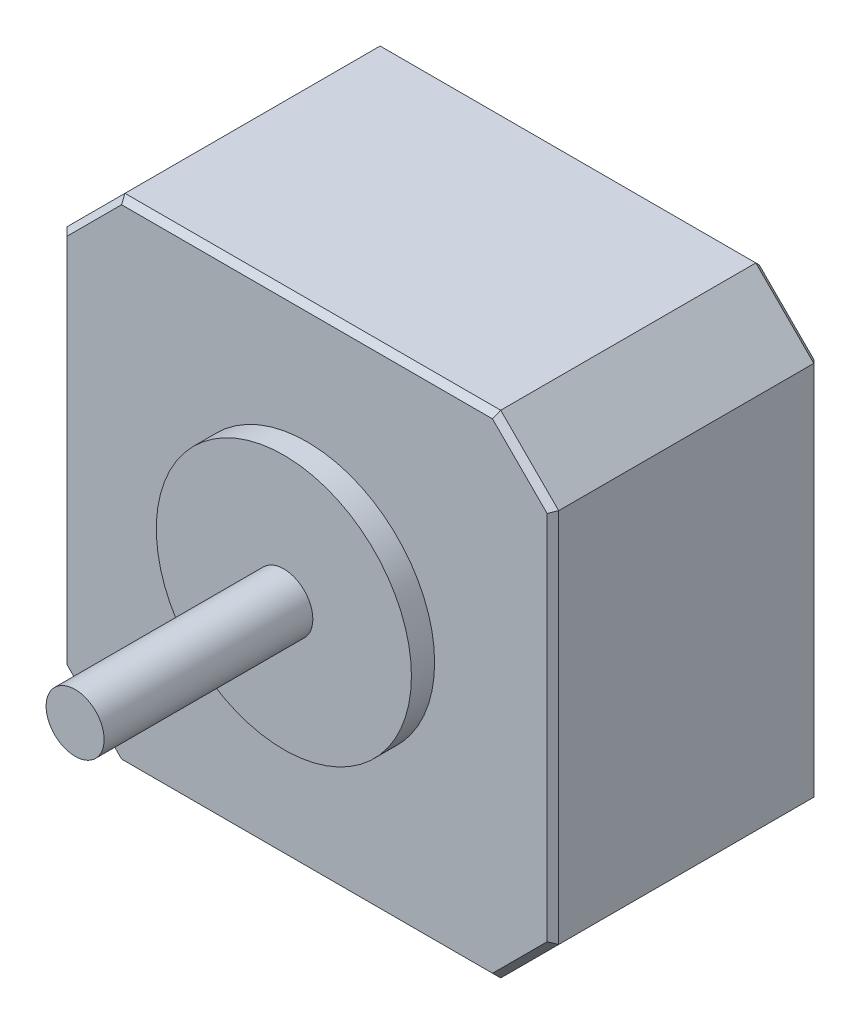
ISO-10303-21;
HEADER;
FILE_DESCRIPTION(('STEP AP214'),'2;1');
FILE_NAME('part.step','',(''),(''),'','','');
FILE_SCHEMA(('AUTOMOTIVE_DESIGN { 1 0 10303 214 1 1 1 1 }'));
ENDSEC;
DATA;
#1=APPLICATION_CONTEXT('core data for automotive mechanical design processes');
#2=APPLICATION_PROTOCOL_DEFINITION('international standard','automotive_design',2000,#1);
#3=PRODUCT_CONTEXT('',#1,'mechanical');
#4=PRODUCT('Part','Part','',(#3));
#5=PRODUCT_RELATED_PRODUCT_CATEGORY('part','',(#4));
#6=PRODUCT_DEFINITION_FORMATION('','',#4);
#7=PRODUCT_DEFINITION_CONTEXT('part definition',#1,'design');
#8=PRODUCT_DEFINITION('design','',#6,#7);
#9=PRODUCT_DEFINITION_SHAPE('','',#8);
#10=(LENGTH_UNIT() NAMED_UNIT(*) SI_UNIT(.MILLI.,.METRE.));
#11=(NAMED_UNIT(*) PLANE_ANGLE_UNIT() SI_UNIT($,.RADIAN.));
#12=(NAMED_UNIT(*) SI_UNIT($,.STERADIAN.) SOLID_ANGLE_UNIT());
#13=UNCERTAINTY_MEASURE_WITH_UNIT(LENGTH_MEASURE(1.E-05),#10,'distance_accuracy_value','');
#14=(GEOMETRIC_REPRESENTATION_CONTEXT(3) GLOBAL_UNCERTAINTY_ASSIGNED_CONTEXT((#13)) GLOBAL_UNIT_ASSIGNED_CONTEXT((#10,
#11,#12)) REPRESENTATION_CONTEXT('',''));
#15=CARTESIAN_POINT('',(0.,0.,0.));
#16=DIRECTION('',(0.,0.,1.));
#17=DIRECTION('',(1.,0.,0.));
#18=AXIS2_PLACEMENT_3D('',#15,#16,#17);
#19=CARTESIAN_POINT('',(0.,0.,0.));
#20=DIRECTION('',(0.,0.,1.));
#21=DIRECTION('',(1.,0.,0.));
#22=AXIS2_PLACEMENT_3D('',#19,#20,#21);
#23=PLANE('',#22);
#24=DIRECTION('',(0.,-1.,0.));
#25=VECTOR('',#24,1.);
#26=CARTESIAN_POINT('',(0.5,0.,0.));
#27=LINE('',#26,#25);
#28=CARTESIAN_POINT('',(0.5,37.1928932188135,0.));
#29=VERTEX_POINT('',#28);
#30=CARTESIAN_POINT('',(0.5,5.20710678118655,0.));
#31=VERTEX_POINT('',#30);
#32=EDGE_CURVE('E135',#29,#31,#27,.T.);
#33=ORIENTED_EDGE('',*,*,#32,.T.);
#34=DIRECTION('',(0.707106781186548,-0.707106781186547,0.));
#35=VECTOR('',#34,1.);
#36=CARTESIAN_POINT('',(2.85355339059328,2.85355339059328,0.));
#37=LINE('',#36,#35);
#38=CARTESIAN_POINT('',(5.20710678118655,0.5,0.));
#39=VERTEX_POINT('',#38);
#40=EDGE_CURVE('E184',#31,#39,#37,.T.);
#41=ORIENTED_EDGE('',*,*,#40,.T.);
#42=DIRECTION('',(1.,0.,0.));
#43=VECTOR('',#42,1.);
#44=CARTESIAN_POINT('',(0.,0.5,0.));
#45=LINE('',#44,#43);
#46=CARTESIAN_POINT('',(37.1928932188135,0.5,0.));
#47=VERTEX_POINT('',#46);
#48=EDGE_CURVE('E181',#39,#47,#45,.T.);
#49=ORIENTED_EDGE('',*,*,#48,.T.);
#50=DIRECTION('',(0.707106781186547,0.707106781186548,0.));
#51=VECTOR('',#50,1.);
#52=CARTESIAN_POINT('',(18.3464466094068,-18.3464466094068,0.));
#53=LINE('',#52,#51);
#54=CARTESIAN_POINT('',(41.9,5.20710678118655,0.));
#55=VERTEX_POINT('',#54);
#56=EDGE_CURVE('E178',#47,#55,#53,.T.);
#57=ORIENTED_EDGE('',*,*,#56,.T.);
#58=DIRECTION('',(0.,1.,0.));
#59=VECTOR('',#58,1.);
#60=CARTESIAN_POINT('',(41.9,0.,0.));
#61=LINE('',#60,#59);
#62=CARTESIAN_POINT('',(41.9,37.1928932188135,0.));
#63=VERTEX_POINT('',#62);
#64=EDGE_CURVE('E175',#55,#63,#61,.T.);
#65=ORIENTED_EDGE('',*,*,#64,.T.);
#66=DIRECTION('',(-0.707106781186548,0.707106781186548,0.));
#67=VECTOR('',#66,1.);
#68=CARTESIAN_POINT('',(39.5464466094068,39.5464466094068,0.));
#69=LINE('',#68,#67);
#70=CARTESIAN_POINT('',(37.1928932188135,41.9,0.));
#71=VERTEX_POINT('',#70);
#72=EDGE_CURVE('E172',#63,#71,#69,.T.);
#73=ORIENTED_EDGE('',*,*,#72,.T.);
#74=DIRECTION('',(-1.,0.,0.));
#75=VECTOR('',#74,1.);
#76=CARTESIAN_POINT('',(0.,41.9,0.));
#77=LINE('',#76,#75);
#78=CARTESIAN_POINT('',(5.20710678118654,41.9,0.));
#79=VERTEX_POINT('',#78);
#80=EDGE_CURVE('E138',#71,#79,#77,.T.);
#81=ORIENTED_EDGE('',*,*,#80,.T.);
#82=DIRECTION('',(-0.707106781186548,-0.707106781186548,0.));
#83=VECTOR('',#82,1.);
#84=CARTESIAN_POINT('',(-18.3464466094068,18.3464466094068,0.));
#85=LINE('',#84,#83);
#86=EDGE_CURVE('E130',#79,#29,#85,.T.);
#87=ORIENTED_EDGE('',*,*,#86,.T.);
#88=EDGE_LOOP('',(#33,#41,#49,#57,#65,#73,#81,#87));
#89=FACE_BOUND('',#88,.T.);
#90=CARTESIAN_POINT('',(21.2,21.2,0.));
#91=DIRECTION('',(0.,0.,1.));
#92=DIRECTION('',(1.,0.,0.));
#93=AXIS2_PLACEMENT_3D('',#90,#91,#92);
#94=CIRCLE('',#93,11.);
#95=CARTESIAN_POINT('',(32.2,21.2,0.));
#96=VERTEX_POINT('',#95);
#97=EDGE_CURVE('E391',#96,#96,#94,.T.);
#98=ORIENTED_EDGE('',*,*,#97,.F.);
#99=EDGE_LOOP('',(#98));
#100=FACE_BOUND('',#99,.T.);
#101=ADVANCED_FACE('F17',(#89,#100),#23,.T.);
#102=CARTESIAN_POINT('',(0.,42.4,-23.));
#103=DIRECTION('',(-1.,0.,0.));
#104=DIRECTION('',(0.,0.,1.));
#105=AXIS2_PLACEMENT_3D('',#102,#103,#104);
#106=PLANE('',#105);
#107=DIRECTION('',(0.,0.,1.));
#108=VECTOR('',#107,1.);
#109=CARTESIAN_POINT('',(0.,5.,-23.));
#110=LINE('',#109,#108);
#111=CARTESIAN_POINT('',(0.,5.,-22.5));
#112=VERTEX_POINT('',#111);
#113=CARTESIAN_POINT('',(0.,5.,-0.5));
#114=VERTEX_POINT('',#113);
#115=EDGE_CURVE('E327',#112,#114,#110,.T.);
#116=ORIENTED_EDGE('',*,*,#115,.T.);
#117=DIRECTION('',(0.,1.,0.));
#118=VECTOR('',#117,1.);
#119=CARTESIAN_POINT('',(0.,42.4,-0.5));
#120=LINE('',#119,#118);
#121=CARTESIAN_POINT('',(0.,37.4,-0.5));
#122=VERTEX_POINT('',#121);
#123=EDGE_CURVE('E233',#114,#122,#120,.T.);
#124=ORIENTED_EDGE('',*,*,#123,.T.);
#125=DIRECTION('',(0.,0.,-1.));
#126=VECTOR('',#125,1.);
#127=CARTESIAN_POINT('',(0.,37.4,-23.));
#128=LINE('',#127,#126);
#129=CARTESIAN_POINT('',(0.,37.4,-22.5));
#130=VERTEX_POINT('',#129);
#131=EDGE_CURVE('E345',#122,#130,#128,.T.);
#132=ORIENTED_EDGE('',*,*,#131,.T.);
#133=DIRECTION('',(0.,-1.,0.));
#134=VECTOR('',#133,1.);
#135=CARTESIAN_POINT('',(0.,5.,-22.5));
#136=LINE('',#135,#134);
#137=EDGE_CURVE('E230',#130,#112,#136,.T.);
#138=ORIENTED_EDGE('',*,*,#137,.T.);
#139=EDGE_LOOP('',(#116,#124,#132,#138));
#140=FACE_BOUND('',#139,.T.);
#141=ADVANCED_FACE('F341',(#140),#106,.T.);
#142=CARTESIAN_POINT('',(0.,0.,-23.));
#143=DIRECTION('',(0.,-1.,0.));
#144=DIRECTION('',(0.,0.,-1.));
#145=AXIS2_PLACEMENT_3D('',#142,#143,#144);
#146=PLANE('',#145);
#147=DIRECTION('',(0.,0.,1.));
#148=VECTOR('',#147,1.);
#149=CARTESIAN_POINT('',(37.4,0.,-23.));
#150=LINE('',#149,#148);
#151=CARTESIAN_POINT('',(37.4,0.,-22.5));
#152=VERTEX_POINT('',#151);
#153=CARTESIAN_POINT('',(37.4,0.,-0.5));
#154=VERTEX_POINT('',#153);
#155=EDGE_CURVE('E166',#152,#154,#150,.T.);
#156=ORIENTED_EDGE('',*,*,#155,.T.);
#157=DIRECTION('',(-1.,0.,0.));
#158=VECTOR('',#157,1.);
#159=CARTESIAN_POINT('',(0.,0.,-0.5));
#160=LINE('',#159,#158);
#161=CARTESIAN_POINT('',(5.,0.,-0.5));
#162=VERTEX_POINT('',#161);
#163=EDGE_CURVE('E197',#154,#162,#160,.T.);
#164=ORIENTED_EDGE('',*,*,#163,.T.);
#165=DIRECTION('',(0.,0.,-1.));
#166=VECTOR('',#165,1.);
#167=CARTESIAN_POINT('',(5.,0.,-23.));
#168=LINE('',#167,#166);
#169=CARTESIAN_POINT('',(5.,0.,-22.5));
#170=VERTEX_POINT('',#169);
#171=EDGE_CURVE('E159',#162,#170,#168,.T.);
#172=ORIENTED_EDGE('',*,*,#171,.T.);
#173=DIRECTION('',(1.,0.,0.));
#174=VECTOR('',#173,1.);
#175=CARTESIAN_POINT('',(37.4,0.,-22.5));
#176=LINE('',#175,#174);
#177=EDGE_CURVE('E194',#170,#152,#176,.T.);
#178=ORIENTED_EDGE('',*,*,#177,.T.);
#179=EDGE_LOOP('',(#156,#164,#172,#178));
#180=FACE_BOUND('',#179,.T.);
#181=ADVANCED_FACE('F330',(#180),#146,.T.);
#182=CARTESIAN_POINT('',(42.4,0.,-23.));
#183=DIRECTION('',(1.,0.,0.));
#184=DIRECTION('',(0.,0.,-1.));
#185=AXIS2_PLACEMENT_3D('',#182,#183,#184);
#186=PLANE('',#185);
#187=DIRECTION('',(0.,0.,1.));
#188=VECTOR('',#187,1.);
#189=CARTESIAN_POINT('',(42.4,37.4,-23.));
#190=LINE('',#189,#188);
#191=CARTESIAN_POINT('',(42.4,37.4,-22.5));
#192=VERTEX_POINT('',#191);
#193=CARTESIAN_POINT('',(42.4,37.4,-0.5));
#194=VERTEX_POINT('',#193);
#195=EDGE_CURVE('E362',#192,#194,#190,.T.);
#196=ORIENTED_EDGE('',*,*,#195,.T.);
#197=DIRECTION('',(0.,-1.,0.));
#198=VECTOR('',#197,1.);
#199=CARTESIAN_POINT('',(42.4,0.,-0.5));
#200=LINE('',#199,#198);
#201=CARTESIAN_POINT('',(42.4,5.,-0.5));
#202=VERTEX_POINT('',#201);
#203=EDGE_CURVE('E209',#194,#202,#200,.T.);
#204=ORIENTED_EDGE('',*,*,#203,.T.);
#205=DIRECTION('',(0.,0.,-1.));
#206=VECTOR('',#205,1.);
#207=CARTESIAN_POINT('',(42.4,5.,-23.));
#208=LINE('',#207,#206);
#209=CARTESIAN_POINT('',(42.4,5.,-22.5));
#210=VERTEX_POINT('',#209);
#211=EDGE_CURVE('E352',#202,#210,#208,.T.);
#212=ORIENTED_EDGE('',*,*,#211,.T.);
#213=DIRECTION('',(0.,1.,0.));
#214=VECTOR('',#213,1.);
#215=CARTESIAN_POINT('',(42.4,37.4,-22.5));
#216=LINE('',#215,#214);
#217=EDGE_CURVE('E206',#210,#192,#216,.T.);
#218=ORIENTED_EDGE('',*,*,#217,.T.);
#219=EDGE_LOOP('',(#196,#204,#212,#218));
#220=FACE_BOUND('',#219,.T.);
#221=ADVANCED_FACE('F824',(#220),#186,.T.);
#222=CARTESIAN_POINT('',(42.4,42.4,-23.));
#223=DIRECTION('',(0.,1.,0.));
#224=DIRECTION('',(0.,0.,1.));
#225=AXIS2_PLACEMENT_3D('',#222,#223,#224);
#226=PLANE('',#225);
#227=DIRECTION('',(0.,0.,1.));
#228=VECTOR('',#227,1.);
#229=CARTESIAN_POINT('',(5.,42.4,-23.));
#230=LINE('',#229,#228);
#231=CARTESIAN_POINT('',(5.,42.4,-22.5));
#232=VERTEX_POINT('',#231);
#233=CARTESIAN_POINT('',(5.,42.4,-0.5));
#234=VERTEX_POINT('',#233);
#235=EDGE_CURVE('E346',#232,#234,#230,.T.);
#236=ORIENTED_EDGE('',*,*,#235,.T.);
#237=DIRECTION('',(1.,0.,0.));
#238=VECTOR('',#237,1.);
#239=CARTESIAN_POINT('',(42.4,42.4,-0.5));
#240=LINE('',#239,#238);
#241=CARTESIAN_POINT('',(37.4,42.4,-0.5));
#242=VERTEX_POINT('',#241);
#243=EDGE_CURVE('E222',#234,#242,#240,.T.);
#244=ORIENTED_EDGE('',*,*,#243,.T.);
#245=DIRECTION('',(0.,0.,-1.));
#246=VECTOR('',#245,1.);
#247=CARTESIAN_POINT('',(37.4,42.4,-23.));
#248=LINE('',#247,#246);
#249=CARTESIAN_POINT('',(37.4,42.4,-22.5));
#250=VERTEX_POINT('',#249);
#251=EDGE_CURVE('E355',#242,#250,#248,.T.);
#252=ORIENTED_EDGE('',*,*,#251,.T.);
#253=DIRECTION('',(-1.,0.,0.));
#254=VECTOR('',#253,1.);
#255=CARTESIAN_POINT('',(5.,42.4,-22.5));
#256=LINE('',#255,#254);
#257=EDGE_CURVE('E219',#250,#232,#256,.T.);
#258=ORIENTED_EDGE('',*,*,#257,.T.);
#259=EDGE_LOOP('',(#236,#244,#252,#258));
#260=FACE_BOUND('',#259,.T.);
#261=ADVANCED_FACE('F811',(#260),#226,.T.);
#262=CARTESIAN_POINT('',(0.,0.,-23.));
#263=DIRECTION('',(0.,0.,1.));
#264=DIRECTION('',(1.,0.,0.));
#265=AXIS2_PLACEMENT_3D('',#262,#263,#264);
#266=PLANE('',#265);
#267=DIRECTION('',(1.,0.,0.));
#268=VECTOR('',#267,1.);
#269=CARTESIAN_POINT('',(37.4,41.9,-23.));
#270=LINE('',#269,#268);
#271=CARTESIAN_POINT('',(5.20710678118654,41.9,-23.));
#272=VERTEX_POINT('',#271);
#273=CARTESIAN_POINT('',(37.1928932188135,41.9,-23.));
#274=VERTEX_POINT('',#273);
#275=EDGE_CURVE('E27',#272,#274,#270,.T.);
#276=ORIENTED_EDGE('',*,*,#275,.T.);
#277=DIRECTION('',(0.707106781186548,-0.707106781186548,0.));
#278=VECTOR('',#277,1.);
#279=CARTESIAN_POINT('',(42.0464466094068,37.0464466094068,-23.));
#280=LINE('',#279,#278);
#281=CARTESIAN_POINT('',(41.9,37.1928932188135,-23.));
#282=VERTEX_POINT('',#281);
#283=EDGE_CURVE('E10',#274,#282,#280,.T.);
#284=ORIENTED_EDGE('',*,*,#283,.T.);
#285=DIRECTION('',(0.,-1.,0.));
#286=VECTOR('',#285,1.);
#287=CARTESIAN_POINT('',(41.9,5.,-23.));
#288=LINE('',#287,#286);
#289=CARTESIAN_POINT('',(41.9,5.20710678118655,-23.));
#290=VERTEX_POINT('',#289);
#291=EDGE_CURVE('E236',#282,#290,#288,.T.);
#292=ORIENTED_EDGE('',*,*,#291,.T.);
#293=DIRECTION('',(-0.707106781186547,-0.707106781186548,0.));
#294=VECTOR('',#293,1.);
#295=CARTESIAN_POINT('',(37.0464466094068,0.353553390593275,-23.));
#296=LINE('',#295,#294);
#297=CARTESIAN_POINT('',(37.1928932188135,0.5,-23.));
#298=VERTEX_POINT('',#297);
#299=EDGE_CURVE('E239',#290,#298,#296,.T.);
#300=ORIENTED_EDGE('',*,*,#299,.T.);
#301=DIRECTION('',(-1.,0.,0.));
#302=VECTOR('',#301,1.);
#303=CARTESIAN_POINT('',(5.,0.5,-23.));
#304=LINE('',#303,#302);
#305=CARTESIAN_POINT('',(5.20710678118655,0.5,-23.));
#306=VERTEX_POINT('',#305);
#307=EDGE_CURVE('E242',#298,#306,#304,.T.);
#308=ORIENTED_EDGE('',*,*,#307,.T.);
#309=DIRECTION('',(-0.707106781186548,0.707106781186547,0.));
#310=VECTOR('',#309,1.);
#311=CARTESIAN_POINT('',(0.353553390593274,5.35355339059327,-23.));
#312=LINE('',#311,#310);
#313=CARTESIAN_POINT('',(0.5,5.20710678118655,-23.));
#314=VERTEX_POINT('',#313);
#315=EDGE_CURVE('E245',#306,#314,#312,.T.);
#316=ORIENTED_EDGE('',*,*,#315,.T.);
#317=DIRECTION('',(0.,1.,0.));
#318=VECTOR('',#317,1.);
#319=CARTESIAN_POINT('',(0.5,37.4,-23.));
#320=LINE('',#319,#318);
#321=CARTESIAN_POINT('',(0.5,37.1928932188135,-23.));
#322=VERTEX_POINT('',#321);
#323=EDGE_CURVE('E248',#314,#322,#320,.T.);
#324=ORIENTED_EDGE('',*,*,#323,.T.);
#325=DIRECTION('',(0.707106781186548,0.707106781186548,0.));
#326=VECTOR('',#325,1.);
#327=CARTESIAN_POINT('',(5.35355339059327,42.0464466094068,-23.));
#328=LINE('',#327,#326);
#329=EDGE_CURVE('E38',#322,#272,#328,.T.);
#330=ORIENTED_EDGE('',*,*,#329,.T.);
#331=EDGE_LOOP('',(#276,#284,#292,#300,#308,#316,#324,#330));
#332=FACE_BOUND('',#331,.T.);
#333=ADVANCED_FACE('F799',(#332),#266,.F.);
#334=CARTESIAN_POINT('',(21.2,21.2,2.));
#335=DIRECTION('',(0.,0.,-1.));
#336=DIRECTION('',(-1.,0.,0.));
#337=AXIS2_PLACEMENT_3D('',#334,#335,#336);
#338=CYLINDRICAL_SURFACE('',#337,11.);
#339=CARTESIAN_POINT('',(21.2,21.2,2.));
#340=DIRECTION('',(0.,0.,1.));
#341=DIRECTION('',(1.,0.,0.));
#342=AXIS2_PLACEMENT_3D('',#339,#340,#341);
#343=CIRCLE('',#342,11.);
#344=CARTESIAN_POINT('',(32.2,21.2,2.));
#345=VERTEX_POINT('',#344);
#346=EDGE_CURVE('E399',#345,#345,#343,.T.);
#347=ORIENTED_EDGE('',*,*,#346,.F.);
#348=EDGE_LOOP('',(#347));
#349=FACE_BOUND('',#348,.T.);
#350=ORIENTED_EDGE('',*,*,#97,.T.);
#351=EDGE_LOOP('',(#350));
#352=FACE_BOUND('',#351,.T.);
#353=ADVANCED_FACE('F788',(#349,#352),#338,.T.);
#354=CARTESIAN_POINT('',(21.2,21.2,2.));
#355=DIRECTION('',(0.,0.,1.));
#356=DIRECTION('',(1.,0.,0.));
#357=AXIS2_PLACEMENT_3D('',#354,#355,#356);
#358=PLANE('',#357);
#359=ORIENTED_EDGE('',*,*,#346,.T.);
#360=EDGE_LOOP('',(#359));
#361=FACE_BOUND('',#360,.T.);
#362=CARTESIAN_POINT('',(21.2,21.2,2.));
#363=DIRECTION('',(0.,0.,-1.));
#364=DIRECTION('',(1.,0.,0.));
#365=AXIS2_PLACEMENT_3D('',#362,#363,#364);
#366=CIRCLE('',#365,2.5);
#367=CARTESIAN_POINT('',(23.7,21.2,2.));
#368=VERTEX_POINT('',#367);
#369=EDGE_CURVE('E406',#368,#368,#366,.T.);
#370=ORIENTED_EDGE('',*,*,#369,.T.);
#371=EDGE_LOOP('',(#370));
#372=FACE_BOUND('',#371,.T.);
#373=ADVANCED_FACE('F776',(#361,#372),#358,.T.);
#374=CARTESIAN_POINT('',(21.2,21.2,20.));
#375=DIRECTION('',(0.,0.,-1.));
#376=DIRECTION('',(-1.,0.,0.));
#377=AXIS2_PLACEMENT_3D('',#374,#375,#376);
#378=CYLINDRICAL_SURFACE('',#377,2.5);
#379=ORIENTED_EDGE('',*,*,#369,.F.);
#380=EDGE_LOOP('',(#379));
#381=FACE_BOUND('',#380,.T.);
#382=CARTESIAN_POINT('',(21.2,21.2,20.));
#383=DIRECTION('',(0.,0.,1.));
#384=DIRECTION('',(1.,0.,0.));
#385=AXIS2_PLACEMENT_3D('',#382,#383,#384);
#386=CIRCLE('',#385,2.5);
#387=CARTESIAN_POINT('',(23.7,21.2,20.));
#388=VERTEX_POINT('',#387);
#389=EDGE_CURVE('E277',#388,#388,#386,.T.);
#390=ORIENTED_EDGE('',*,*,#389,.F.);
#391=EDGE_LOOP('',(#390));
#392=FACE_BOUND('',#391,.T.);
#393=ADVANCED_FACE('F764',(#381,#392),#378,.T.);
#394=CARTESIAN_POINT('',(21.2,21.2,20.));
#395=DIRECTION('',(0.,0.,1.));
#396=DIRECTION('',(1.,0.,0.));
#397=AXIS2_PLACEMENT_3D('',#394,#395,#396);
#398=PLANE('',#397);
#399=ORIENTED_EDGE('',*,*,#389,.T.);
#400=EDGE_LOOP('',(#399));
#401=FACE_BOUND('',#400,.T.);
#402=ADVANCED_FACE('F752',(#401),#398,.T.);
#403=CARTESIAN_POINT('',(5.,42.4,-23.));
#404=DIRECTION('',(0.707106781186548,-0.707106781186548,0.));
#405=DIRECTION('',(0.,0.,1.));
#406=AXIS2_PLACEMENT_3D('',#403,#404,#405);
#407=PLANE('',#406);
#408=ORIENTED_EDGE('',*,*,#131,.F.);
#409=DIRECTION('',(-0.707106781186548,-0.707106781186548,0.));
#410=VECTOR('',#409,1.);
#411=CARTESIAN_POINT('',(5.,42.4,-0.5));
#412=LINE('',#411,#410);
#413=EDGE_CURVE('E148',#122,#234,#412,.F.);
#414=ORIENTED_EDGE('',*,*,#413,.T.);
#415=ORIENTED_EDGE('',*,*,#235,.F.);
#416=DIRECTION('',(0.707106781186548,0.707106781186548,0.));
#417=VECTOR('',#416,1.);
#418=CARTESIAN_POINT('',(0.,37.4,-22.5));
#419=LINE('',#418,#417);
#420=EDGE_CURVE('E225',#232,#130,#419,.F.);
#421=ORIENTED_EDGE('',*,*,#420,.T.);
#422=EDGE_LOOP('',(#408,#414,#415,#421));
#423=FACE_BOUND('',#422,.T.);
#424=ADVANCED_FACE('F740',(#423),#407,.F.);
#425=CARTESIAN_POINT('',(42.4,37.4,-23.));
#426=DIRECTION('',(-0.707106781186548,-0.707106781186548,0.));
#427=DIRECTION('',(0.,0.,1.));
#428=AXIS2_PLACEMENT_3D('',#425,#426,#427);
#429=PLANE('',#428);
#430=ORIENTED_EDGE('',*,*,#251,.F.);
#431=DIRECTION('',(-0.707106781186548,0.707106781186548,0.));
#432=VECTOR('',#431,1.);
#433=CARTESIAN_POINT('',(42.4,37.4,-0.5));
#434=LINE('',#433,#432);
#435=EDGE_CURVE('E216',#242,#194,#434,.F.);
#436=ORIENTED_EDGE('',*,*,#435,.T.);
#437=ORIENTED_EDGE('',*,*,#195,.F.);
#438=DIRECTION('',(0.707106781186548,-0.707106781186548,0.));
#439=VECTOR('',#438,1.);
#440=CARTESIAN_POINT('',(37.4,42.4,-22.5));
#441=LINE('',#440,#439);
#442=EDGE_CURVE('E212',#192,#250,#441,.F.);
#443=ORIENTED_EDGE('',*,*,#442,.T.);
#444=EDGE_LOOP('',(#430,#436,#437,#443));
#445=FACE_BOUND('',#444,.T.);
#446=ADVANCED_FACE('F729',(#445),#429,.F.);
#447=CARTESIAN_POINT('',(0.,5.,-23.));
#448=DIRECTION('',(0.707106781186547,0.707106781186548,0.));
#449=DIRECTION('',(0.,0.,1.));
#450=AXIS2_PLACEMENT_3D('',#447,#448,#449);
#451=PLANE('',#450);
#452=ORIENTED_EDGE('',*,*,#171,.F.);
#453=DIRECTION('',(0.707106781186548,-0.707106781186547,0.));
#454=VECTOR('',#453,1.);
#455=CARTESIAN_POINT('',(0.,5.,-0.5));
#456=LINE('',#455,#454);
#457=EDGE_CURVE('E190',#162,#114,#456,.F.);
#458=ORIENTED_EDGE('',*,*,#457,.T.);
#459=ORIENTED_EDGE('',*,*,#115,.F.);
#460=DIRECTION('',(-0.707106781186548,0.707106781186547,0.));
#461=VECTOR('',#460,1.);
#462=CARTESIAN_POINT('',(5.,0.,-22.5));
#463=LINE('',#462,#461);
#464=EDGE_CURVE('E187',#112,#170,#463,.F.);
#465=ORIENTED_EDGE('',*,*,#464,.T.);
#466=EDGE_LOOP('',(#452,#458,#459,#465));
#467=FACE_BOUND('',#466,.T.);
#468=ADVANCED_FACE('F324',(#467),#451,.F.);
#469=CARTESIAN_POINT('',(37.4,0.,-23.));
#470=DIRECTION('',(-0.707106781186548,0.707106781186547,0.));
#471=DIRECTION('',(0.,0.,1.));
#472=AXIS2_PLACEMENT_3D('',#469,#470,#471);
#473=PLANE('',#472);
#474=ORIENTED_EDGE('',*,*,#211,.F.);
#475=DIRECTION('',(0.707106781186547,0.707106781186548,0.));
#476=VECTOR('',#475,1.);
#477=CARTESIAN_POINT('',(37.4,0.,-0.5));
#478=LINE('',#477,#476);
#479=EDGE_CURVE('E203',#202,#154,#478,.F.);
#480=ORIENTED_EDGE('',*,*,#479,.T.);
#481=ORIENTED_EDGE('',*,*,#155,.F.);
#482=DIRECTION('',(-0.707106781186547,-0.707106781186548,0.));
#483=VECTOR('',#482,1.);
#484=CARTESIAN_POINT('',(42.4,5.,-22.5));
#485=LINE('',#484,#483);
#486=EDGE_CURVE('E200',#152,#210,#485,.F.);
#487=ORIENTED_EDGE('',*,*,#486,.T.);
#488=EDGE_LOOP('',(#474,#480,#481,#487));
#489=FACE_BOUND('',#488,.T.);
#490=ADVANCED_FACE('F706',(#489),#473,.F.);
#491=CARTESIAN_POINT('',(39.5464466094068,39.5464466094068,0.));
#492=DIRECTION('',(0.500000000000008,0.500000000000008,0.707106781186536));
#493=DIRECTION('',(0.707106781186548,-0.707106781186548,0.));
#494=AXIS2_PLACEMENT_3D('',#491,#492,#493);
#495=PLANE('',#494);
#496=DIRECTION('',(-0.678598344545853,-0.281084637714791,0.678598344545853));
#497=VECTOR('',#496,1.);
#498=CARTESIAN_POINT('',(41.2651239283051,36.9299189394913,0.634876071694969));
#499=LINE('',#498,#497);
#500=EDGE_CURVE('E269',#194,#63,#499,.T.);
#501=ORIENTED_EDGE('',*,*,#500,.F.);
#502=ORIENTED_EDGE('',*,*,#435,.F.);
#503=DIRECTION('',(-0.281084637714791,-0.678598344545853,0.678598344545853));
#504=VECTOR('',#503,1.);
#505=CARTESIAN_POINT('',(34.2543357790533,34.8056947751179,7.09430522488211));
#506=LINE('',#505,#504);
#507=EDGE_CURVE('E273',#71,#242,#506,.F.);
#508=ORIENTED_EDGE('',*,*,#507,.F.);
#509=ORIENTED_EDGE('',*,*,#72,.F.);
#510=EDGE_LOOP('',(#501,#502,#508,#509));
#511=FACE_BOUND('',#510,.T.);
#512=ADVANCED_FACE('F695',(#511),#495,.T.);
#513=CARTESIAN_POINT('',(0.,41.9,0.));
#514=DIRECTION('',(0.,-0.707106781186548,-0.707106781186548));
#515=DIRECTION('',(-1.,0.,0.));
#516=AXIS2_PLACEMENT_3D('',#513,#514,#515);
#517=PLANE('',#516);
#518=ORIENTED_EDGE('',*,*,#507,.T.);
#519=ORIENTED_EDGE('',*,*,#243,.F.);
#520=DIRECTION('',(0.281084637714808,-0.67859834454585,0.67859834454585));
#521=VECTOR('',#520,1.);
#522=CARTESIAN_POINT('',(7.83886298145973,35.5463784884407,6.35362151155931));
#523=LINE('',#522,#521);
#524=EDGE_CURVE('E266',#79,#234,#523,.F.);
#525=ORIENTED_EDGE('',*,*,#524,.F.);
#526=ORIENTED_EDGE('',*,*,#80,.F.);
#527=EDGE_LOOP('',(#518,#519,#525,#526));
#528=FACE_BOUND('',#527,.T.);
#529=ADVANCED_FACE('F684',(#528),#517,.F.);
#530=CARTESIAN_POINT('',(41.9,0.,0.));
#531=DIRECTION('',(-0.707106781186548,0.,-0.707106781186548));
#532=DIRECTION('',(0.,1.,0.));
#533=AXIS2_PLACEMENT_3D('',#530,#531,#532);
#534=PLANE('',#533);
#535=ORIENTED_EDGE('',*,*,#500,.T.);
#536=ORIENTED_EDGE('',*,*,#64,.F.);
#537=DIRECTION('',(-0.678598344545848,0.281084637714818,0.678598344545848));
#538=VECTOR('',#537,1.);
#539=CARTESIAN_POINT('',(42.8932221359323,4.7957007020342,-0.993222135932357));
#540=LINE('',#539,#538);
#541=EDGE_CURVE('E152',#202,#55,#540,.T.);
#542=ORIENTED_EDGE('',*,*,#541,.F.);
#543=ORIENTED_EDGE('',*,*,#203,.F.);
#544=EDGE_LOOP('',(#535,#536,#542,#543));
#545=FACE_BOUND('',#544,.T.);
#546=ADVANCED_FACE('F674',(#545),#534,.F.);
#547=CARTESIAN_POINT('',(-18.3464466094068,18.3464466094068,0.));
#548=DIRECTION('',(-0.5,0.5,0.707106781186543));
#549=DIRECTION('',(0.707106781186548,0.707106781186548,0.));
#550=AXIS2_PLACEMENT_3D('',#547,#548,#549);
#551=PLANE('',#550);
#552=ORIENTED_EDGE('',*,*,#524,.T.);
#553=ORIENTED_EDGE('',*,*,#413,.F.);
#554=DIRECTION('',(0.678598344545849,-0.281084637714809,0.67859834454585));
#555=VECTOR('',#554,1.);
#556=CARTESIAN_POINT('',(7.59430522488252,34.254335779053,7.09430522488253));
#557=LINE('',#556,#555);
#558=EDGE_CURVE('E146',#29,#122,#557,.F.);
#559=ORIENTED_EDGE('',*,*,#558,.F.);
#560=ORIENTED_EDGE('',*,*,#86,.F.);
#561=EDGE_LOOP('',(#552,#553,#559,#560));
#562=FACE_BOUND('',#561,.T.);
#563=ADVANCED_FACE('F147',(#562),#551,.T.);
#564=CARTESIAN_POINT('',(18.3464466094068,-18.3464466094068,0.));
#565=DIRECTION('',(0.5,-0.5,0.707106781186547));
#566=DIRECTION('',(-0.707106781186547,-0.707106781186548,0.));
#567=AXIS2_PLACEMENT_3D('',#564,#565,#566);
#568=PLANE('',#567);
#569=ORIENTED_EDGE('',*,*,#541,.T.);
#570=ORIENTED_EDGE('',*,*,#56,.F.);
#571=DIRECTION('',(-0.281084637714818,0.678598344545847,0.678598344545848));
#572=VECTOR('',#571,1.);
#573=CARTESIAN_POINT('',(39.2987008604423,-4.58386936816927,-5.08386936816927));
#574=LINE('',#573,#572);
#575=EDGE_CURVE('E153',#154,#47,#574,.T.);
#576=ORIENTED_EDGE('',*,*,#575,.F.);
#577=ORIENTED_EDGE('',*,*,#479,.F.);
#578=EDGE_LOOP('',(#569,#570,#576,#577));
#579=FACE_BOUND('',#578,.T.);
#580=ADVANCED_FACE('F654',(#579),#568,.T.);
#581=CARTESIAN_POINT('',(0.5,0.,0.));
#582=DIRECTION('',(0.707106781186548,0.,-0.707106781186547));
#583=DIRECTION('',(0.,-1.,0.));
#584=AXIS2_PLACEMENT_3D('',#581,#582,#583);
#585=PLANE('',#584);
#586=ORIENTED_EDGE('',*,*,#558,.T.);
#587=ORIENTED_EDGE('',*,*,#123,.F.);
#588=DIRECTION('',(-0.678598344545847,-0.281084637714821,-0.678598344545847));
#589=VECTOR('',#588,1.);
#590=CARTESIAN_POINT('',(-0.493222135932367,4.79570070203418,-0.993222135932368));
#591=LINE('',#590,#589);
#592=EDGE_CURVE('E156',#31,#114,#591,.T.);
#593=ORIENTED_EDGE('',*,*,#592,.F.);
#594=ORIENTED_EDGE('',*,*,#32,.F.);
#595=EDGE_LOOP('',(#586,#587,#593,#594));
#596=FACE_BOUND('',#595,.T.);
#597=ADVANCED_FACE('F155',(#596),#585,.F.);
#598=CARTESIAN_POINT('',(0.,0.5,0.));
#599=DIRECTION('',(0.,0.707106781186548,-0.707106781186547));
#600=DIRECTION('',(1.,0.,0.));
#601=AXIS2_PLACEMENT_3D('',#598,#599,#600);
#602=PLANE('',#601);
#603=ORIENTED_EDGE('',*,*,#575,.T.);
#604=ORIENTED_EDGE('',*,*,#48,.F.);
#605=DIRECTION('',(0.281084637714821,0.678598344545847,0.678598344545847));
#606=VECTOR('',#605,1.);
#607=CARTESIAN_POINT('',(4.79570070203419,-0.493222135932368,-0.993222135932368));
#608=LINE('',#607,#606);
#609=EDGE_CURVE('E255',#162,#39,#608,.T.);
#610=ORIENTED_EDGE('',*,*,#609,.F.);
#611=ORIENTED_EDGE('',*,*,#163,.F.);
#612=EDGE_LOOP('',(#603,#604,#610,#611));
#613=FACE_BOUND('',#612,.T.);
#614=ADVANCED_FACE('F336',(#613),#602,.F.);
#615=CARTESIAN_POINT('',(2.85355339059328,2.85355339059328,0.));
#616=DIRECTION('',(-0.5,-0.5,0.707106781186547));
#617=DIRECTION('',(-0.707106781186548,0.707106781186547,0.));
#618=AXIS2_PLACEMENT_3D('',#615,#616,#617);
#619=PLANE('',#618);
#620=ORIENTED_EDGE('',*,*,#592,.T.);
#621=ORIENTED_EDGE('',*,*,#457,.F.);
#622=ORIENTED_EDGE('',*,*,#609,.T.);
#623=ORIENTED_EDGE('',*,*,#40,.F.);
#624=EDGE_LOOP('',(#620,#621,#622,#623));
#625=FACE_BOUND('',#624,.T.);
#626=ADVANCED_FACE('F339',(#625),#619,.T.);
#627=CARTESIAN_POINT('',(2.85355339059328,2.85355339059328,-23.));
#628=DIRECTION('',(0.5,0.5,0.707106781186547));
#629=DIRECTION('',(-0.707106781186548,0.707106781186547,0.));
#630=AXIS2_PLACEMENT_3D('',#627,#628,#629);
#631=PLANE('',#630);
#632=DIRECTION('',(-0.281084637714821,-0.678598344545847,0.678598344545847));
#633=VECTOR('',#632,1.);
#634=CARTESIAN_POINT('',(4.60495713220364,-0.953717849152732,-21.5462821508473));
#635=LINE('',#634,#633);
#636=EDGE_CURVE('E299',#170,#306,#635,.F.);
#637=ORIENTED_EDGE('',*,*,#636,.F.);
#638=ORIENTED_EDGE('',*,*,#464,.F.);
#639=DIRECTION('',(-0.678598344545847,-0.281084637714821,0.678598344545847));
#640=VECTOR('',#639,1.);
#641=CARTESIAN_POINT('',(1.13487607169491,5.47008106050873,-23.6348760716949));
#642=LINE('',#641,#640);
#643=EDGE_CURVE('E21',#314,#112,#642,.T.);
#644=ORIENTED_EDGE('',*,*,#643,.F.);
#645=ORIENTED_EDGE('',*,*,#315,.F.);
#646=EDGE_LOOP('',(#637,#638,#644,#645));
#647=FACE_BOUND('',#646,.T.);
#648=ADVANCED_FACE('F19',(#647),#631,.F.);
#649=CARTESIAN_POINT('',(0.,42.4,-22.5));
#650=DIRECTION('',(-0.707106781186548,0.,-0.707106781186547));
#651=DIRECTION('',(0.,1.,0.));
#652=AXIS2_PLACEMENT_3D('',#649,#650,#651);
#653=PLANE('',#652);
#654=ORIENTED_EDGE('',*,*,#643,.T.);
#655=ORIENTED_EDGE('',*,*,#137,.F.);
#656=DIRECTION('',(-0.678598344545847,0.281084637714821,0.678598344545847));
#657=VECTOR('',#656,1.);
#658=CARTESIAN_POINT('',(-0.953717849152731,37.7950428677963,-21.5462821508473));
#659=LINE('',#658,#657);
#660=EDGE_CURVE('E296',#322,#130,#659,.T.);
#661=ORIENTED_EDGE('',*,*,#660,.F.);
#662=ORIENTED_EDGE('',*,*,#323,.F.);
#663=EDGE_LOOP('',(#654,#655,#661,#662));
#664=FACE_BOUND('',#663,.T.);
#665=ADVANCED_FACE('F316',(#664),#653,.T.);
#666=CARTESIAN_POINT('',(0.,0.,-22.5));
#667=DIRECTION('',(0.,-0.707106781186548,-0.707106781186547));
#668=DIRECTION('',(-1.,0.,0.));
#669=AXIS2_PLACEMENT_3D('',#666,#667,#668);
#670=PLANE('',#669);
#671=ORIENTED_EDGE('',*,*,#636,.T.);
#672=ORIENTED_EDGE('',*,*,#307,.F.);
#673=DIRECTION('',(0.281084637714818,-0.678598344545847,0.678598344545848));
#674=VECTOR('',#673,1.);
#675=CARTESIAN_POINT('',(39.2987008604423,-4.58386936816927,-17.9161306318308));
#676=LINE('',#675,#674);
#677=EDGE_CURVE('E292',#152,#298,#676,.F.);
#678=ORIENTED_EDGE('',*,*,#677,.F.);
#679=ORIENTED_EDGE('',*,*,#177,.F.);
#680=EDGE_LOOP('',(#671,#672,#678,#679));
#681=FACE_BOUND('',#680,.T.);
#682=ADVANCED_FACE('F593',(#681),#670,.T.);
#683=CARTESIAN_POINT('',(-18.3464466094068,18.3464466094068,-23.));
#684=DIRECTION('',(0.5,-0.5,0.707106781186548));
#685=DIRECTION('',(0.707106781186548,0.707106781186548,0.));
#686=AXIS2_PLACEMENT_3D('',#683,#684,#685);
#687=PLANE('',#686);
#688=ORIENTED_EDGE('',*,*,#660,.T.);
#689=ORIENTED_EDGE('',*,*,#420,.F.);
#690=DIRECTION('',(-0.28108463771482,0.678598344545847,0.678598344545847));
#691=VECTOR('',#690,1.);
#692=CARTESIAN_POINT('',(7.83886298145975,35.546378488441,-29.353621511559));
#693=LINE('',#692,#691);
#694=EDGE_CURVE('E288',#272,#232,#693,.T.);
#695=ORIENTED_EDGE('',*,*,#694,.F.);
#696=ORIENTED_EDGE('',*,*,#329,.F.);
#697=EDGE_LOOP('',(#688,#689,#695,#696));
#698=FACE_BOUND('',#697,.T.);
#699=ADVANCED_FACE('F581',(#698),#687,.F.);
#700=CARTESIAN_POINT('',(18.3464466094068,-18.3464466094068,-23.));
#701=DIRECTION('',(-0.5,0.5,0.707106781186547));
#702=DIRECTION('',(-0.707106781186547,-0.707106781186548,0.));
#703=AXIS2_PLACEMENT_3D('',#700,#701,#702);
#704=PLANE('',#703);
#705=ORIENTED_EDGE('',*,*,#677,.T.);
#706=ORIENTED_EDGE('',*,*,#299,.F.);
#707=DIRECTION('',(0.678598344545848,-0.281084637714818,0.678598344545848));
#708=VECTOR('',#707,1.);
#709=CARTESIAN_POINT('',(43.3537178491527,4.60495713220365,-21.5462821508473));
#710=LINE('',#709,#708);
#711=EDGE_CURVE('E284',#210,#290,#710,.F.);
#712=ORIENTED_EDGE('',*,*,#711,.F.);
#713=ORIENTED_EDGE('',*,*,#486,.F.);
#714=EDGE_LOOP('',(#705,#706,#712,#713));
#715=FACE_BOUND('',#714,.T.);
#716=ADVANCED_FACE('F568',(#715),#704,.F.);
#717=CARTESIAN_POINT('',(42.4,42.4,-22.5));
#718=DIRECTION('',(0.,0.707106781186548,-0.707106781186548));
#719=DIRECTION('',(1.,0.,0.));
#720=AXIS2_PLACEMENT_3D('',#717,#718,#719);
#721=PLANE('',#720);
#722=ORIENTED_EDGE('',*,*,#694,.T.);
#723=ORIENTED_EDGE('',*,*,#257,.F.);
#724=DIRECTION('',(0.281084637714826,0.678598344545846,0.678598344545846));
#725=VECTOR('',#724,1.);
#726=CARTESIAN_POINT('',(37.7950428677964,43.3537178491528,-21.5462821508473));
#727=LINE('',#726,#725);
#728=EDGE_CURVE('E281',#274,#250,#727,.T.);
#729=ORIENTED_EDGE('',*,*,#728,.F.);
#730=ORIENTED_EDGE('',*,*,#275,.F.);
#731=EDGE_LOOP('',(#722,#723,#729,#730));
#732=FACE_BOUND('',#731,.T.);
#733=ADVANCED_FACE('F554',(#732),#721,.T.);
#734=CARTESIAN_POINT('',(42.4,0.,-22.5));
#735=DIRECTION('',(0.707106781186548,0.,-0.707106781186548));
#736=DIRECTION('',(0.,-1.,0.));
#737=AXIS2_PLACEMENT_3D('',#734,#735,#736);
#738=PLANE('',#737);
#739=ORIENTED_EDGE('',*,*,#711,.T.);
#740=ORIENTED_EDGE('',*,*,#291,.F.);
#741=DIRECTION('',(-0.678598344545846,-0.281084637714826,-0.678598344545846));
#742=VECTOR('',#741,1.);
#743=CARTESIAN_POINT('',(35.2661904883375,34.4450793488831,-29.6338095116625));
#744=LINE('',#743,#742);
#745=EDGE_CURVE('E278',#192,#282,#744,.T.);
#746=ORIENTED_EDGE('',*,*,#745,.F.);
#747=ORIENTED_EDGE('',*,*,#217,.F.);
#748=EDGE_LOOP('',(#739,#740,#746,#747));
#749=FACE_BOUND('',#748,.T.);
#750=ADVANCED_FACE('F539',(#749),#738,.T.);
#751=CARTESIAN_POINT('',(39.5464466094068,39.5464466094068,-23.));
#752=DIRECTION('',(-0.5,-0.5,0.70710678118655));
#753=DIRECTION('',(0.707106781186548,-0.707106781186548,0.));
#754=AXIS2_PLACEMENT_3D('',#751,#752,#753);
#755=PLANE('',#754);
#756=ORIENTED_EDGE('',*,*,#728,.T.);
#757=ORIENTED_EDGE('',*,*,#442,.F.);
#758=ORIENTED_EDGE('',*,*,#745,.T.);
#759=ORIENTED_EDGE('',*,*,#283,.F.);
#760=EDGE_LOOP('',(#756,#757,#758,#759));
#761=FACE_BOUND('',#760,.T.);
#762=ADVANCED_FACE('F533',(#761),#755,.F.);
#763=CLOSED_SHELL('',(#101,#141,#181,#221,#261,#333,#353,#373,#393,#402,#424,#446,#468,#490,
#512,#529,#546,#563,#580,#597,#614,#626,#648,#665,#682,#699,#716,#733,#750,#762));
#764=MANIFOLD_SOLID_BREP('B1',#763);
#765=ADVANCED_BREP_SHAPE_REPRESENTATION('',(#18,#764),#14);
#766=SHAPE_DEFINITION_REPRESENTATION(#9,#765);
ENDSEC;
END-ISO-10303-21;
